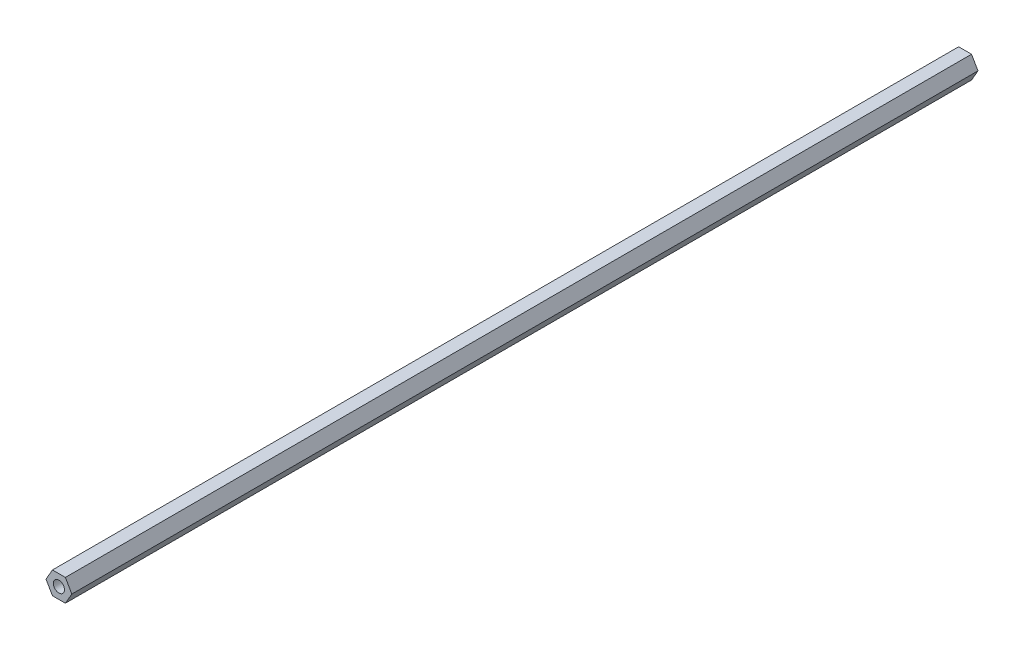
ISO-10303-21;
HEADER;
FILE_DESCRIPTION(('STEP AP214'),'2;1');
FILE_NAME('part.step','',(''),(''),'','','');
FILE_SCHEMA(('AUTOMOTIVE_DESIGN { 1 0 10303 214 1 1 1 1 }'));
ENDSEC;
DATA;
#1=APPLICATION_CONTEXT('core data for automotive mechanical design processes');
#2=APPLICATION_PROTOCOL_DEFINITION('international standard','automotive_design',2000,#1);
#3=PRODUCT_CONTEXT('',#1,'mechanical');
#4=PRODUCT('Part','Part','',(#3));
#5=PRODUCT_RELATED_PRODUCT_CATEGORY('part','',(#4));
#6=PRODUCT_DEFINITION_FORMATION('','',#4);
#7=PRODUCT_DEFINITION_CONTEXT('part definition',#1,'design');
#8=PRODUCT_DEFINITION('design','',#6,#7);
#9=PRODUCT_DEFINITION_SHAPE('','',#8);
#10=(LENGTH_UNIT() NAMED_UNIT(*) SI_UNIT(.MILLI.,.METRE.));
#11=(NAMED_UNIT(*) PLANE_ANGLE_UNIT() SI_UNIT($,.RADIAN.));
#12=(NAMED_UNIT(*) SI_UNIT($,.STERADIAN.) SOLID_ANGLE_UNIT());
#13=UNCERTAINTY_MEASURE_WITH_UNIT(LENGTH_MEASURE(1.E-05),#10,'distance_accuracy_value','');
#14=(GEOMETRIC_REPRESENTATION_CONTEXT(3) GLOBAL_UNCERTAINTY_ASSIGNED_CONTEXT((#13)) GLOBAL_UNIT_ASSIGNED_CONTEXT((#10,
#11,#12)) REPRESENTATION_CONTEXT('',''));
#15=CARTESIAN_POINT('',(0.,0.,0.));
#16=DIRECTION('',(0.,0.,1.));
#17=DIRECTION('',(1.,0.,0.));
#18=AXIS2_PLACEMENT_3D('',#15,#16,#17);
#19=CARTESIAN_POINT('',(0.,6.35,559.282920441985));
#20=DIRECTION('',(0.,-1.,0.));
#21=DIRECTION('',(1.,0.,0.));
#22=AXIS2_PLACEMENT_3D('',#19,#20,#21);
#23=PLANE('',#22);
#24=DIRECTION('',(-1.,0.,0.));
#25=VECTOR('',#24,1.);
#26=CARTESIAN_POINT('',(1.41251224281279E-13,6.35,514.483350000005));
#27=LINE('',#26,#25);
#28=CARTESIAN_POINT('',(3.66617420935413,6.35,514.483350000005));
#29=VERTEX_POINT('',#28);
#30=CARTESIAN_POINT('',(-3.66617420935413,6.35,514.483350000005));
#31=VERTEX_POINT('',#30);
#32=EDGE_CURVE('E130',#29,#31,#27,.T.);
#33=ORIENTED_EDGE('',*,*,#32,.F.);
#34=DIRECTION('',(0.,0.,-1.));
#35=VECTOR('',#34,1.);
#36=CARTESIAN_POINT('',(3.66617420935413,6.35,559.282920441985));
#37=LINE('',#36,#35);
#38=CARTESIAN_POINT('',(3.66617420935413,6.35,0.));
#39=VERTEX_POINT('',#38);
#40=EDGE_CURVE('E61',#29,#39,#37,.T.);
#41=ORIENTED_EDGE('',*,*,#40,.T.);
#42=DIRECTION('',(-1.,0.,0.));
#43=VECTOR('',#42,1.);
#44=CARTESIAN_POINT('',(0.,6.35,0.));
#45=LINE('',#44,#43);
#46=CARTESIAN_POINT('',(-3.66617420935413,6.35,0.));
#47=VERTEX_POINT('',#46);
#48=EDGE_CURVE('E141',#39,#47,#45,.T.);
#49=ORIENTED_EDGE('',*,*,#48,.T.);
#50=DIRECTION('',(0.,0.,-1.));
#51=VECTOR('',#50,1.);
#52=CARTESIAN_POINT('',(-3.66617420935413,6.35,559.282920441985));
#53=LINE('',#52,#51);
#54=EDGE_CURVE('E92',#31,#47,#53,.T.);
#55=ORIENTED_EDGE('',*,*,#54,.F.);
#56=EDGE_LOOP('',(#33,#41,#49,#55));
#57=FACE_BOUND('',#56,.T.);
#58=ADVANCED_FACE('F43',(#57),#23,.F.);
#59=CARTESIAN_POINT('',(-5.49926131403119,3.175,559.282920441985));
#60=DIRECTION('',(0.866025403784439,-0.5,0.));
#61=DIRECTION('',(0.5,0.866025403784439,0.));
#62=AXIS2_PLACEMENT_3D('',#59,#60,#61);
#63=PLANE('',#62);
#64=DIRECTION('',(-0.5,-0.866025403784439,0.));
#65=VECTOR('',#64,1.);
#66=CARTESIAN_POINT('',(-5.49926131403126,3.17499999999988,514.483350000005));
#67=LINE('',#66,#65);
#68=CARTESIAN_POINT('',(-7.33234841870824,0.,514.483350000005));
#69=VERTEX_POINT('',#68);
#70=EDGE_CURVE('E99',#31,#69,#67,.T.);
#71=ORIENTED_EDGE('',*,*,#70,.F.);
#72=ORIENTED_EDGE('',*,*,#54,.T.);
#73=DIRECTION('',(-0.5,-0.866025403784439,0.));
#74=VECTOR('',#73,1.);
#75=CARTESIAN_POINT('',(-5.49926131403119,3.175,0.));
#76=LINE('',#75,#74);
#77=CARTESIAN_POINT('',(-7.33234841870824,0.,0.));
#78=VERTEX_POINT('',#77);
#79=EDGE_CURVE('E140',#47,#78,#76,.T.);
#80=ORIENTED_EDGE('',*,*,#79,.T.);
#81=DIRECTION('',(0.,0.,-1.));
#82=VECTOR('',#81,1.);
#83=CARTESIAN_POINT('',(-7.33234841870824,0.,559.282920441985));
#84=LINE('',#83,#82);
#85=EDGE_CURVE('E142',#69,#78,#84,.T.);
#86=ORIENTED_EDGE('',*,*,#85,.F.);
#87=EDGE_LOOP('',(#71,#72,#80,#86));
#88=FACE_BOUND('',#87,.T.);
#89=ADVANCED_FACE('F176',(#88),#63,.F.);
#90=CARTESIAN_POINT('',(-5.49926131403119,-3.175,559.282920441985));
#91=DIRECTION('',(0.866025403784439,0.5,0.));
#92=DIRECTION('',(-0.5,0.866025403784439,0.));
#93=AXIS2_PLACEMENT_3D('',#90,#91,#92);
#94=PLANE('',#93);
#95=DIRECTION('',(0.5,-0.866025403784439,0.));
#96=VECTOR('',#95,1.);
#97=CARTESIAN_POINT('',(-5.49926131403104,-3.17500000000024,514.483350000005));
#98=LINE('',#97,#96);
#99=CARTESIAN_POINT('',(-3.66617420935412,-6.35000000000001,514.483350000005));
#100=VERTEX_POINT('',#99);
#101=EDGE_CURVE('E121',#69,#100,#98,.T.);
#102=ORIENTED_EDGE('',*,*,#101,.F.);
#103=ORIENTED_EDGE('',*,*,#85,.T.);
#104=DIRECTION('',(0.5,-0.866025403784439,0.));
#105=VECTOR('',#104,1.);
#106=CARTESIAN_POINT('',(-5.49926131403119,-3.175,0.));
#107=LINE('',#106,#105);
#108=CARTESIAN_POINT('',(-3.66617420935412,-6.35000000000001,0.));
#109=VERTEX_POINT('',#108);
#110=EDGE_CURVE('E145',#78,#109,#107,.T.);
#111=ORIENTED_EDGE('',*,*,#110,.T.);
#112=DIRECTION('',(0.,0.,-1.));
#113=VECTOR('',#112,1.);
#114=CARTESIAN_POINT('',(-3.66617420935412,-6.35000000000001,559.282920441985));
#115=LINE('',#114,#113);
#116=EDGE_CURVE('E146',#100,#109,#115,.T.);
#117=ORIENTED_EDGE('',*,*,#116,.F.);
#118=EDGE_LOOP('',(#102,#103,#111,#117));
#119=FACE_BOUND('',#118,.T.);
#120=ADVANCED_FACE('F181',(#119),#94,.F.);
#121=CARTESIAN_POINT('',(0.,-6.35000000000001,559.282920441985));
#122=DIRECTION('',(0.,1.,0.));
#123=DIRECTION('',(-1.,0.,0.));
#124=AXIS2_PLACEMENT_3D('',#121,#122,#123);
#125=PLANE('',#124);
#126=DIRECTION('',(1.,0.,0.));
#127=VECTOR('',#126,1.);
#128=CARTESIAN_POINT('',(1.47260482676227E-13,-6.35000000000001,514.483350000005));
#129=LINE('',#128,#127);
#130=CARTESIAN_POINT('',(3.66617420935413,-6.35,514.483350000005));
#131=VERTEX_POINT('',#130);
#132=EDGE_CURVE('E53',#100,#131,#129,.T.);
#133=ORIENTED_EDGE('',*,*,#132,.F.);
#134=ORIENTED_EDGE('',*,*,#116,.T.);
#135=DIRECTION('',(1.,0.,0.));
#136=VECTOR('',#135,1.);
#137=CARTESIAN_POINT('',(0.,-6.35000000000001,0.));
#138=LINE('',#137,#136);
#139=CARTESIAN_POINT('',(3.66617420935413,-6.35,0.));
#140=VERTEX_POINT('',#139);
#141=EDGE_CURVE('E115',#109,#140,#138,.T.);
#142=ORIENTED_EDGE('',*,*,#141,.T.);
#143=DIRECTION('',(0.,0.,-1.));
#144=VECTOR('',#143,1.);
#145=CARTESIAN_POINT('',(3.66617420935413,-6.35,559.282920441985));
#146=LINE('',#145,#144);
#147=EDGE_CURVE('E106',#131,#140,#146,.T.);
#148=ORIENTED_EDGE('',*,*,#147,.F.);
#149=EDGE_LOOP('',(#133,#134,#142,#148));
#150=FACE_BOUND('',#149,.T.);
#151=ADVANCED_FACE('F112',(#150),#125,.F.);
#152=CARTESIAN_POINT('',(5.49926131403119,-3.175,559.282920441985));
#153=DIRECTION('',(-0.866025403784439,0.5,0.));
#154=DIRECTION('',(-0.5,-0.866025403784439,0.));
#155=AXIS2_PLACEMENT_3D('',#152,#153,#154);
#156=PLANE('',#155);
#157=DIRECTION('',(0.5,0.866025403784439,0.));
#158=VECTOR('',#157,1.);
#159=CARTESIAN_POINT('',(5.49926131403112,-3.17500000000012,514.483350000005));
#160=LINE('',#159,#158);
#161=CARTESIAN_POINT('',(7.33234841870825,0.,514.483350000005));
#162=VERTEX_POINT('',#161);
#163=EDGE_CURVE('E11',#131,#162,#160,.T.);
#164=ORIENTED_EDGE('',*,*,#163,.F.);
#165=ORIENTED_EDGE('',*,*,#147,.T.);
#166=DIRECTION('',(0.5,0.866025403784439,0.));
#167=VECTOR('',#166,1.);
#168=CARTESIAN_POINT('',(5.49926131403119,-3.175,0.));
#169=LINE('',#168,#167);
#170=CARTESIAN_POINT('',(7.33234841870825,0.,0.));
#171=VERTEX_POINT('',#170);
#172=EDGE_CURVE('E118',#140,#171,#169,.T.);
#173=ORIENTED_EDGE('',*,*,#172,.T.);
#174=DIRECTION('',(0.,0.,-1.));
#175=VECTOR('',#174,1.);
#176=CARTESIAN_POINT('',(7.33234841870825,0.,559.282920441985));
#177=LINE('',#176,#175);
#178=EDGE_CURVE('E67',#162,#171,#177,.T.);
#179=ORIENTED_EDGE('',*,*,#178,.F.);
#180=EDGE_LOOP('',(#164,#165,#173,#179));
#181=FACE_BOUND('',#180,.T.);
#182=ADVANCED_FACE('F105',(#181),#156,.F.);
#183=CARTESIAN_POINT('',(5.49926131403119,3.17500000000001,559.282920441985));
#184=DIRECTION('',(-0.866025403784438,-0.500000000000001,0.));
#185=DIRECTION('',(0.500000000000001,-0.866025403784438,0.));
#186=AXIS2_PLACEMENT_3D('',#183,#184,#185);
#187=PLANE('',#186);
#188=DIRECTION('',(-0.500000000000001,0.866025403784438,0.));
#189=VECTOR('',#188,1.);
#190=CARTESIAN_POINT('',(5.49926131403133,3.17499999999976,514.483350000005));
#191=LINE('',#190,#189);
#192=EDGE_CURVE('E134',#162,#29,#191,.T.);
#193=ORIENTED_EDGE('',*,*,#192,.F.);
#194=ORIENTED_EDGE('',*,*,#178,.T.);
#195=DIRECTION('',(-0.500000000000001,0.866025403784438,0.));
#196=VECTOR('',#195,1.);
#197=CARTESIAN_POINT('',(5.49926131403119,3.17500000000001,0.));
#198=LINE('',#197,#196);
#199=EDGE_CURVE('E137',#171,#39,#198,.T.);
#200=ORIENTED_EDGE('',*,*,#199,.T.);
#201=ORIENTED_EDGE('',*,*,#40,.F.);
#202=EDGE_LOOP('',(#193,#194,#200,#201));
#203=FACE_BOUND('',#202,.T.);
#204=ADVANCED_FACE('F193',(#203),#187,.F.);
#205=CARTESIAN_POINT('',(0.,0.,0.));
#206=DIRECTION('',(0.,0.,1.));
#207=DIRECTION('',(1.,0.,0.));
#208=AXIS2_PLACEMENT_3D('',#205,#206,#207);
#209=PLANE('',#208);
#210=CARTESIAN_POINT('',(0.,0.,0.));
#211=DIRECTION('',(0.,0.,1.));
#212=DIRECTION('',(1.,0.,0.));
#213=AXIS2_PLACEMENT_3D('',#210,#211,#212);
#214=CIRCLE('',#213,3.17499999999746);
#215=CARTESIAN_POINT('',(3.17499999999746,0.,0.));
#216=VERTEX_POINT('',#215);
#217=EDGE_CURVE('E156',#216,#216,#214,.T.);
#218=ORIENTED_EDGE('',*,*,#217,.T.);
#219=EDGE_LOOP('',(#218));
#220=FACE_BOUND('',#219,.T.);
#221=ORIENTED_EDGE('',*,*,#48,.F.);
#222=ORIENTED_EDGE('',*,*,#199,.F.);
#223=ORIENTED_EDGE('',*,*,#172,.F.);
#224=ORIENTED_EDGE('',*,*,#141,.F.);
#225=ORIENTED_EDGE('',*,*,#110,.F.);
#226=ORIENTED_EDGE('',*,*,#79,.F.);
#227=EDGE_LOOP('',(#221,#222,#223,#224,#225,#226));
#228=FACE_BOUND('',#227,.T.);
#229=ADVANCED_FACE('F179',(#220,#228),#209,.F.);
#230=CARTESIAN_POINT('',(7.77874999999913,-13.4731902193747,514.483350000006));
#231=DIRECTION('',(0.,0.,1.));
#232=DIRECTION('',(0.5,-0.866025403784438,0.));
#233=AXIS2_PLACEMENT_3D('',#230,#231,#232);
#234=PLANE('',#233);
#235=CARTESIAN_POINT('',(0.,0.,514.483350000005));
#236=DIRECTION('',(0.,0.,1.));
#237=DIRECTION('',(0.,-1.,0.));
#238=AXIS2_PLACEMENT_3D('',#235,#236,#237);
#239=CIRCLE('',#238,3.17499999999746);
#240=CARTESIAN_POINT('',(0.,-3.17499999999746,514.483350000005));
#241=VERTEX_POINT('',#240);
#242=EDGE_CURVE('E47',#241,#241,#239,.T.);
#243=ORIENTED_EDGE('',*,*,#242,.F.);
#244=EDGE_LOOP('',(#243));
#245=FACE_BOUND('',#244,.T.);
#246=ORIENTED_EDGE('',*,*,#192,.T.);
#247=ORIENTED_EDGE('',*,*,#32,.T.);
#248=ORIENTED_EDGE('',*,*,#70,.T.);
#249=ORIENTED_EDGE('',*,*,#101,.T.);
#250=ORIENTED_EDGE('',*,*,#132,.T.);
#251=ORIENTED_EDGE('',*,*,#163,.T.);
#252=EDGE_LOOP('',(#246,#247,#248,#249,#250,#251));
#253=FACE_BOUND('',#252,.T.);
#254=ADVANCED_FACE('F45',(#245,#253),#234,.T.);
#255=CARTESIAN_POINT('',(0.,0.,0.));
#256=DIRECTION('',(0.,0.,1.));
#257=DIRECTION('',(1.,0.,0.));
#258=AXIS2_PLACEMENT_3D('',#255,#256,#257);
#259=CYLINDRICAL_SURFACE('',#258,3.17499999999746);
#260=ORIENTED_EDGE('',*,*,#242,.T.);
#261=EDGE_LOOP('',(#260));
#262=FACE_BOUND('',#261,.T.);
#263=ORIENTED_EDGE('',*,*,#217,.F.);
#264=EDGE_LOOP('',(#263));
#265=FACE_BOUND('',#264,.T.);
#266=ADVANCED_FACE('F203',(#262,#265),#259,.F.);
#267=CLOSED_SHELL('',(#58,#89,#120,#151,#182,#204,#229,#254,#266));
#268=MANIFOLD_SOLID_BREP('B2',#267);
#269=ADVANCED_BREP_SHAPE_REPRESENTATION('',(#18,#268),#14);
#270=SHAPE_DEFINITION_REPRESENTATION(#9,#269);
ENDSEC;
END-ISO-10303-21;
